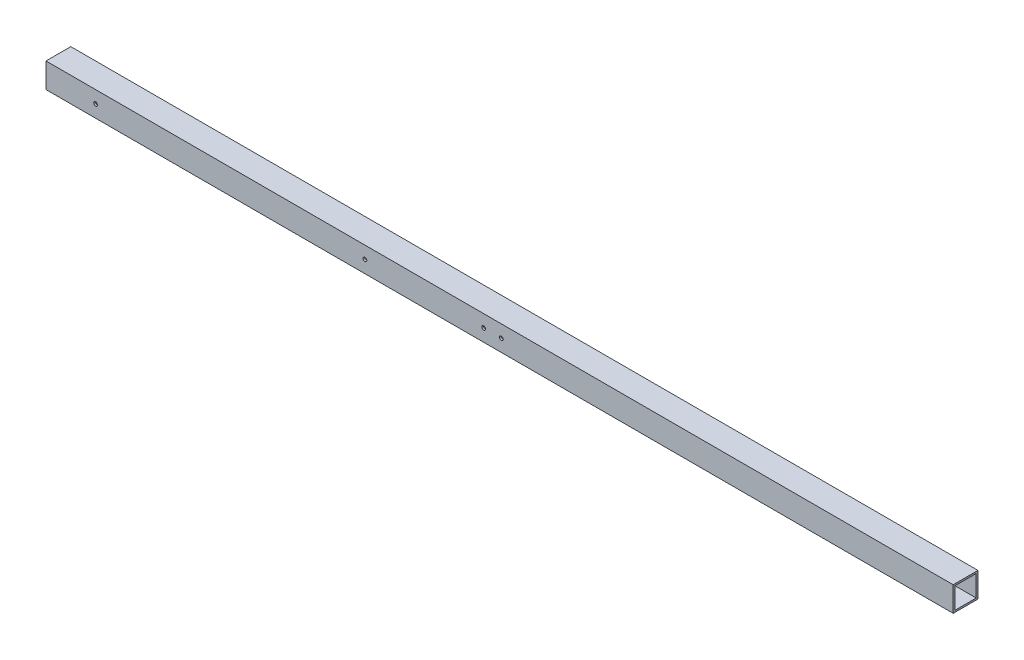
ISO-10303-21;
HEADER;
FILE_DESCRIPTION(('STEP AP214'),'2;1');
FILE_NAME('part.step','',(''),(''),'','','');
FILE_SCHEMA(('AUTOMOTIVE_DESIGN { 1 0 10303 214 1 1 1 1 }'));
ENDSEC;
DATA;
#1=APPLICATION_CONTEXT('core data for automotive mechanical design processes');
#2=APPLICATION_PROTOCOL_DEFINITION('international standard','automotive_design',2000,#1);
#3=PRODUCT_CONTEXT('',#1,'mechanical');
#4=PRODUCT('Part','Part','',(#3));
#5=PRODUCT_RELATED_PRODUCT_CATEGORY('part','',(#4));
#6=PRODUCT_DEFINITION_FORMATION('','',#4);
#7=PRODUCT_DEFINITION_CONTEXT('part definition',#1,'design');
#8=PRODUCT_DEFINITION('design','',#6,#7);
#9=PRODUCT_DEFINITION_SHAPE('','',#8);
#10=(LENGTH_UNIT() NAMED_UNIT(*) SI_UNIT(.MILLI.,.METRE.));
#11=(NAMED_UNIT(*) PLANE_ANGLE_UNIT() SI_UNIT($,.RADIAN.));
#12=(NAMED_UNIT(*) SI_UNIT($,.STERADIAN.) SOLID_ANGLE_UNIT());
#13=UNCERTAINTY_MEASURE_WITH_UNIT(LENGTH_MEASURE(1.E-05),#10,'distance_accuracy_value','');
#14=(GEOMETRIC_REPRESENTATION_CONTEXT(3) GLOBAL_UNCERTAINTY_ASSIGNED_CONTEXT((#13)) GLOBAL_UNIT_ASSIGNED_CONTEXT((#10,
#11,#12)) REPRESENTATION_CONTEXT('',''));
#15=CARTESIAN_POINT('',(0.,0.,0.));
#16=DIRECTION('',(0.,0.,1.));
#17=DIRECTION('',(1.,0.,0.));
#18=AXIS2_PLACEMENT_3D('',#15,#16,#17);
#19=CARTESIAN_POINT('',(1625.6,0.,0.));
#20=DIRECTION('',(-1.,0.,0.));
#21=DIRECTION('',(0.,0.,1.));
#22=AXIS2_PLACEMENT_3D('',#19,#20,#21);
#23=PLANE('',#22);
#24=DIRECTION('',(0.,-1.,0.));
#25=VECTOR('',#24,1.);
#26=CARTESIAN_POINT('',(1625.6,0.,0.));
#27=LINE('',#26,#25);
#28=CARTESIAN_POINT('',(1625.6,44.45,0.));
#29=VERTEX_POINT('',#28);
#30=CARTESIAN_POINT('',(1625.6,0.,0.));
#31=VERTEX_POINT('',#30);
#32=EDGE_CURVE('E139',#29,#31,#27,.T.);
#33=ORIENTED_EDGE('',*,*,#32,.T.);
#34=DIRECTION('',(0.,0.,-1.));
#35=VECTOR('',#34,1.);
#36=CARTESIAN_POINT('',(1625.6,0.,0.));
#37=LINE('',#36,#35);
#38=CARTESIAN_POINT('',(1625.6,0.,-44.45));
#39=VERTEX_POINT('',#38);
#40=EDGE_CURVE('E142',#31,#39,#37,.T.);
#41=ORIENTED_EDGE('',*,*,#40,.T.);
#42=DIRECTION('',(0.,1.,0.));
#43=VECTOR('',#42,1.);
#44=CARTESIAN_POINT('',(1625.6,0.,-44.45));
#45=LINE('',#44,#43);
#46=CARTESIAN_POINT('',(1625.6,44.45,-44.45));
#47=VERTEX_POINT('',#46);
#48=EDGE_CURVE('E145',#39,#47,#45,.T.);
#49=ORIENTED_EDGE('',*,*,#48,.T.);
#50=DIRECTION('',(0.,0.,1.));
#51=VECTOR('',#50,1.);
#52=CARTESIAN_POINT('',(1625.6,44.45,0.));
#53=LINE('',#52,#51);
#54=EDGE_CURVE('E147',#47,#29,#53,.T.);
#55=ORIENTED_EDGE('',*,*,#54,.T.);
#56=EDGE_LOOP('',(#33,#41,#49,#55));
#57=FACE_BOUND('',#56,.T.);
#58=DIRECTION('',(0.,-1.,0.));
#59=VECTOR('',#58,1.);
#60=CARTESIAN_POINT('',(1625.6,41.275,-3.175));
#61=LINE('',#60,#59);
#62=CARTESIAN_POINT('',(1625.6,41.275,-3.175));
#63=VERTEX_POINT('',#62);
#64=CARTESIAN_POINT('',(1625.6,3.175,-3.175));
#65=VERTEX_POINT('',#64);
#66=EDGE_CURVE('E101',#63,#65,#61,.T.);
#67=ORIENTED_EDGE('',*,*,#66,.F.);
#68=DIRECTION('',(0.,0.,1.));
#69=VECTOR('',#68,1.);
#70=CARTESIAN_POINT('',(1625.6,41.275,-3.175));
#71=LINE('',#70,#69);
#72=CARTESIAN_POINT('',(1625.6,41.275,-41.275));
#73=VERTEX_POINT('',#72);
#74=EDGE_CURVE('E123',#73,#63,#71,.T.);
#75=ORIENTED_EDGE('',*,*,#74,.F.);
#76=DIRECTION('',(0.,1.,0.));
#77=VECTOR('',#76,1.);
#78=CARTESIAN_POINT('',(1625.6,41.275,-41.275));
#79=LINE('',#78,#77);
#80=CARTESIAN_POINT('',(1625.6,3.175,-41.275));
#81=VERTEX_POINT('',#80);
#82=EDGE_CURVE('E121',#81,#73,#79,.T.);
#83=ORIENTED_EDGE('',*,*,#82,.F.);
#84=DIRECTION('',(0.,0.,-1.));
#85=VECTOR('',#84,1.);
#86=CARTESIAN_POINT('',(1625.6,3.175,-3.175));
#87=LINE('',#86,#85);
#88=EDGE_CURVE('E109',#65,#81,#87,.T.);
#89=ORIENTED_EDGE('',*,*,#88,.F.);
#90=EDGE_LOOP('',(#67,#75,#83,#89));
#91=FACE_BOUND('',#90,.T.);
#92=ADVANCED_FACE('F34',(#57,#91),#23,.F.);
#93=CARTESIAN_POINT('',(0.,0.,0.));
#94=DIRECTION('',(-1.,0.,0.));
#95=DIRECTION('',(0.,0.,1.));
#96=AXIS2_PLACEMENT_3D('',#93,#94,#95);
#97=PLANE('',#96);
#98=DIRECTION('',(0.,-1.,0.));
#99=VECTOR('',#98,1.);
#100=CARTESIAN_POINT('',(0.,0.,0.));
#101=LINE('',#100,#99);
#102=CARTESIAN_POINT('',(0.,44.45,0.));
#103=VERTEX_POINT('',#102);
#104=CARTESIAN_POINT('',(0.,0.,0.));
#105=VERTEX_POINT('',#104);
#106=EDGE_CURVE('E117',#103,#105,#101,.T.);
#107=ORIENTED_EDGE('',*,*,#106,.F.);
#108=DIRECTION('',(0.,0.,1.));
#109=VECTOR('',#108,1.);
#110=CARTESIAN_POINT('',(0.,44.45,0.));
#111=LINE('',#110,#109);
#112=CARTESIAN_POINT('',(0.,44.45,-44.45));
#113=VERTEX_POINT('',#112);
#114=EDGE_CURVE('E143',#113,#103,#111,.T.);
#115=ORIENTED_EDGE('',*,*,#114,.F.);
#116=DIRECTION('',(0.,1.,0.));
#117=VECTOR('',#116,1.);
#118=CARTESIAN_POINT('',(0.,0.,-44.45));
#119=LINE('',#118,#117);
#120=CARTESIAN_POINT('',(0.,0.,-44.45));
#121=VERTEX_POINT('',#120);
#122=EDGE_CURVE('E154',#121,#113,#119,.T.);
#123=ORIENTED_EDGE('',*,*,#122,.F.);
#124=DIRECTION('',(0.,0.,-1.));
#125=VECTOR('',#124,1.);
#126=CARTESIAN_POINT('',(0.,0.,0.));
#127=LINE('',#126,#125);
#128=EDGE_CURVE('E152',#105,#121,#127,.T.);
#129=ORIENTED_EDGE('',*,*,#128,.F.);
#130=EDGE_LOOP('',(#107,#115,#123,#129));
#131=FACE_BOUND('',#130,.T.);
#132=DIRECTION('',(0.,0.,1.));
#133=VECTOR('',#132,1.);
#134=CARTESIAN_POINT('',(0.,41.275,-3.175));
#135=LINE('',#134,#133);
#136=CARTESIAN_POINT('',(0.,41.275,-41.275));
#137=VERTEX_POINT('',#136);
#138=CARTESIAN_POINT('',(0.,41.275,-3.175));
#139=VERTEX_POINT('',#138);
#140=EDGE_CURVE('E110',#137,#139,#135,.T.);
#141=ORIENTED_EDGE('',*,*,#140,.T.);
#142=DIRECTION('',(0.,-1.,0.));
#143=VECTOR('',#142,1.);
#144=CARTESIAN_POINT('',(0.,41.275,-3.175));
#145=LINE('',#144,#143);
#146=CARTESIAN_POINT('',(0.,3.175,-3.175));
#147=VERTEX_POINT('',#146);
#148=EDGE_CURVE('E59',#139,#147,#145,.T.);
#149=ORIENTED_EDGE('',*,*,#148,.T.);
#150=DIRECTION('',(0.,0.,-1.));
#151=VECTOR('',#150,1.);
#152=CARTESIAN_POINT('',(0.,3.175,-3.175));
#153=LINE('',#152,#151);
#154=CARTESIAN_POINT('',(0.,3.175,-41.275));
#155=VERTEX_POINT('',#154);
#156=EDGE_CURVE('E116',#147,#155,#153,.T.);
#157=ORIENTED_EDGE('',*,*,#156,.T.);
#158=DIRECTION('',(0.,1.,0.));
#159=VECTOR('',#158,1.);
#160=CARTESIAN_POINT('',(0.,41.275,-41.275));
#161=LINE('',#160,#159);
#162=EDGE_CURVE('E131',#155,#137,#161,.T.);
#163=ORIENTED_EDGE('',*,*,#162,.T.);
#164=EDGE_LOOP('',(#141,#149,#157,#163));
#165=FACE_BOUND('',#164,.T.);
#166=ADVANCED_FACE('F206',(#131,#165),#97,.T.);
#167=CARTESIAN_POINT('',(1625.6,0.,0.));
#168=DIRECTION('',(0.,0.,-1.));
#169=DIRECTION('',(-1.,0.,0.));
#170=AXIS2_PLACEMENT_3D('',#167,#168,#169);
#171=PLANE('',#170);
#172=CARTESIAN_POINT('',(88.8999999999999,22.225,0.));
#173=DIRECTION('',(0.,0.,1.));
#174=DIRECTION('',(1.,0.,0.));
#175=AXIS2_PLACEMENT_3D('',#172,#173,#174);
#176=CIRCLE('',#175,3.37343749999999);
#177=CARTESIAN_POINT('',(92.2734374999999,22.225,0.));
#178=VERTEX_POINT('',#177);
#179=EDGE_CURVE('E259',#178,#178,#176,.T.);
#180=ORIENTED_EDGE('',*,*,#179,.F.);
#181=EDGE_LOOP('',(#180));
#182=FACE_BOUND('',#181,.T.);
#183=CARTESIAN_POINT('',(571.5,22.225,0.));
#184=DIRECTION('',(0.,0.,1.));
#185=DIRECTION('',(1.,0.,0.));
#186=AXIS2_PLACEMENT_3D('',#183,#184,#185);
#187=CIRCLE('',#186,3.37343749999992);
#188=CARTESIAN_POINT('',(574.8734375,22.225,0.));
#189=VERTEX_POINT('',#188);
#190=EDGE_CURVE('E263',#189,#189,#187,.T.);
#191=ORIENTED_EDGE('',*,*,#190,.F.);
#192=EDGE_LOOP('',(#191));
#193=FACE_BOUND('',#192,.T.);
#194=CARTESIAN_POINT('',(815.975,22.225,0.));
#195=DIRECTION('',(0.,0.,1.));
#196=DIRECTION('',(1.,0.,0.));
#197=AXIS2_PLACEMENT_3D('',#194,#195,#196);
#198=CIRCLE('',#197,3.37343749999992);
#199=CARTESIAN_POINT('',(819.3484375,22.225,0.));
#200=VERTEX_POINT('',#199);
#201=EDGE_CURVE('E267',#200,#200,#198,.T.);
#202=ORIENTED_EDGE('',*,*,#201,.F.);
#203=EDGE_LOOP('',(#202));
#204=FACE_BOUND('',#203,.T.);
#205=CARTESIAN_POINT('',(784.225,22.225,0.));
#206=DIRECTION('',(0.,0.,1.));
#207=DIRECTION('',(1.,0.,0.));
#208=AXIS2_PLACEMENT_3D('',#205,#206,#207);
#209=CIRCLE('',#208,3.37343749999992);
#210=CARTESIAN_POINT('',(787.5984375,22.225,0.));
#211=VERTEX_POINT('',#210);
#212=EDGE_CURVE('E270',#211,#211,#209,.T.);
#213=ORIENTED_EDGE('',*,*,#212,.F.);
#214=EDGE_LOOP('',(#213));
#215=FACE_BOUND('',#214,.T.);
#216=ORIENTED_EDGE('',*,*,#106,.T.);
#217=DIRECTION('',(-1.,0.,0.));
#218=VECTOR('',#217,1.);
#219=CARTESIAN_POINT('',(1625.6,0.,0.));
#220=LINE('',#219,#218);
#221=EDGE_CURVE('E11',#31,#105,#220,.T.);
#222=ORIENTED_EDGE('',*,*,#221,.F.);
#223=ORIENTED_EDGE('',*,*,#32,.F.);
#224=DIRECTION('',(-1.,0.,0.));
#225=VECTOR('',#224,1.);
#226=CARTESIAN_POINT('',(1625.6,44.45,0.));
#227=LINE('',#226,#225);
#228=EDGE_CURVE('E149',#29,#103,#227,.T.);
#229=ORIENTED_EDGE('',*,*,#228,.T.);
#230=EDGE_LOOP('',(#216,#222,#223,#229));
#231=FACE_BOUND('',#230,.T.);
#232=ADVANCED_FACE('F36',(#182,#193,#204,#215,#231),#171,.F.);
#233=CARTESIAN_POINT('',(1625.6,0.,0.));
#234=DIRECTION('',(0.,1.,0.));
#235=DIRECTION('',(0.,0.,1.));
#236=AXIS2_PLACEMENT_3D('',#233,#234,#235);
#237=PLANE('',#236);
#238=ORIENTED_EDGE('',*,*,#128,.T.);
#239=DIRECTION('',(-1.,0.,0.));
#240=VECTOR('',#239,1.);
#241=CARTESIAN_POINT('',(1625.6,0.,-44.45));
#242=LINE('',#241,#240);
#243=EDGE_CURVE('E43',#39,#121,#242,.T.);
#244=ORIENTED_EDGE('',*,*,#243,.F.);
#245=ORIENTED_EDGE('',*,*,#40,.F.);
#246=ORIENTED_EDGE('',*,*,#221,.T.);
#247=EDGE_LOOP('',(#238,#244,#245,#246));
#248=FACE_BOUND('',#247,.T.);
#249=ADVANCED_FACE('F234',(#248),#237,.F.);
#250=CARTESIAN_POINT('',(1625.6,0.,-44.45));
#251=DIRECTION('',(0.,0.,1.));
#252=DIRECTION('',(1.,0.,0.));
#253=AXIS2_PLACEMENT_3D('',#250,#251,#252);
#254=PLANE('',#253);
#255=CARTESIAN_POINT('',(88.8999999999999,22.225,-44.45));
#256=DIRECTION('',(0.,0.,1.));
#257=DIRECTION('',(1.,0.,0.));
#258=AXIS2_PLACEMENT_3D('',#255,#256,#257);
#259=CIRCLE('',#258,3.37343749999999);
#260=CARTESIAN_POINT('',(92.2734374999999,22.225,-44.45));
#261=VERTEX_POINT('',#260);
#262=EDGE_CURVE('E279',#261,#261,#259,.T.);
#263=ORIENTED_EDGE('',*,*,#262,.T.);
#264=EDGE_LOOP('',(#263));
#265=FACE_BOUND('',#264,.T.);
#266=CARTESIAN_POINT('',(571.5,22.225,-44.45));
#267=DIRECTION('',(0.,0.,1.));
#268=DIRECTION('',(1.,0.,0.));
#269=AXIS2_PLACEMENT_3D('',#266,#267,#268);
#270=CIRCLE('',#269,3.37343749999992);
#271=CARTESIAN_POINT('',(574.8734375,22.225,-44.45));
#272=VERTEX_POINT('',#271);
#273=EDGE_CURVE('E283',#272,#272,#270,.T.);
#274=ORIENTED_EDGE('',*,*,#273,.T.);
#275=EDGE_LOOP('',(#274));
#276=FACE_BOUND('',#275,.T.);
#277=CARTESIAN_POINT('',(815.975,22.225,-44.45));
#278=DIRECTION('',(0.,0.,1.));
#279=DIRECTION('',(1.,0.,0.));
#280=AXIS2_PLACEMENT_3D('',#277,#278,#279);
#281=CIRCLE('',#280,3.37343749999992);
#282=CARTESIAN_POINT('',(819.3484375,22.225,-44.45));
#283=VERTEX_POINT('',#282);
#284=EDGE_CURVE('E272',#283,#283,#281,.T.);
#285=ORIENTED_EDGE('',*,*,#284,.T.);
#286=EDGE_LOOP('',(#285));
#287=FACE_BOUND('',#286,.T.);
#288=CARTESIAN_POINT('',(784.225,22.225,-44.45));
#289=DIRECTION('',(0.,0.,1.));
#290=DIRECTION('',(1.,0.,0.));
#291=AXIS2_PLACEMENT_3D('',#288,#289,#290);
#292=CIRCLE('',#291,3.37343749999992);
#293=CARTESIAN_POINT('',(787.5984375,22.225,-44.45));
#294=VERTEX_POINT('',#293);
#295=EDGE_CURVE('E168',#294,#294,#292,.T.);
#296=ORIENTED_EDGE('',*,*,#295,.T.);
#297=EDGE_LOOP('',(#296));
#298=FACE_BOUND('',#297,.T.);
#299=ORIENTED_EDGE('',*,*,#122,.T.);
#300=DIRECTION('',(-1.,0.,0.));
#301=VECTOR('',#300,1.);
#302=CARTESIAN_POINT('',(1625.6,44.45,-44.45));
#303=LINE('',#302,#301);
#304=EDGE_CURVE('E159',#47,#113,#303,.T.);
#305=ORIENTED_EDGE('',*,*,#304,.F.);
#306=ORIENTED_EDGE('',*,*,#48,.F.);
#307=ORIENTED_EDGE('',*,*,#243,.T.);
#308=EDGE_LOOP('',(#299,#305,#306,#307));
#309=FACE_BOUND('',#308,.T.);
#310=ADVANCED_FACE('F231',(#265,#276,#287,#298,#309),#254,.F.);
#311=CARTESIAN_POINT('',(1625.6,44.45,0.));
#312=DIRECTION('',(0.,-1.,0.));
#313=DIRECTION('',(0.,0.,-1.));
#314=AXIS2_PLACEMENT_3D('',#311,#312,#313);
#315=PLANE('',#314);
#316=ORIENTED_EDGE('',*,*,#114,.T.);
#317=ORIENTED_EDGE('',*,*,#228,.F.);
#318=ORIENTED_EDGE('',*,*,#54,.F.);
#319=ORIENTED_EDGE('',*,*,#304,.T.);
#320=EDGE_LOOP('',(#316,#317,#318,#319));
#321=FACE_BOUND('',#320,.T.);
#322=ADVANCED_FACE('F228',(#321),#315,.F.);
#323=CARTESIAN_POINT('',(1625.6,41.275,-3.175));
#324=DIRECTION('',(0.,0.,-1.));
#325=DIRECTION('',(0.,1.,0.));
#326=AXIS2_PLACEMENT_3D('',#323,#324,#325);
#327=PLANE('',#326);
#328=CARTESIAN_POINT('',(88.8999999999999,22.225,-3.175));
#329=DIRECTION('',(0.,0.,-1.));
#330=DIRECTION('',(0.,1.,0.));
#331=AXIS2_PLACEMENT_3D('',#328,#329,#330);
#332=CIRCLE('',#331,3.37343749999999);
#333=CARTESIAN_POINT('',(88.8999999999999,25.5984375,-3.175));
#334=VERTEX_POINT('',#333);
#335=EDGE_CURVE('E129',#334,#334,#332,.T.);
#336=ORIENTED_EDGE('',*,*,#335,.F.);
#337=EDGE_LOOP('',(#336));
#338=FACE_BOUND('',#337,.T.);
#339=CARTESIAN_POINT('',(571.5,22.225,-3.175));
#340=DIRECTION('',(0.,0.,-1.));
#341=DIRECTION('',(0.,1.,0.));
#342=AXIS2_PLACEMENT_3D('',#339,#340,#341);
#343=CIRCLE('',#342,3.37343749999992);
#344=CARTESIAN_POINT('',(571.5,25.5984374999999,-3.175));
#345=VERTEX_POINT('',#344);
#346=EDGE_CURVE('E174',#345,#345,#343,.T.);
#347=ORIENTED_EDGE('',*,*,#346,.F.);
#348=EDGE_LOOP('',(#347));
#349=FACE_BOUND('',#348,.T.);
#350=CARTESIAN_POINT('',(815.975,22.225,-3.175));
#351=DIRECTION('',(0.,0.,-1.));
#352=DIRECTION('',(0.,1.,0.));
#353=AXIS2_PLACEMENT_3D('',#350,#351,#352);
#354=CIRCLE('',#353,3.37343749999992);
#355=CARTESIAN_POINT('',(815.975,25.5984374999999,-3.175));
#356=VERTEX_POINT('',#355);
#357=EDGE_CURVE('E171',#356,#356,#354,.T.);
#358=ORIENTED_EDGE('',*,*,#357,.F.);
#359=EDGE_LOOP('',(#358));
#360=FACE_BOUND('',#359,.T.);
#361=CARTESIAN_POINT('',(784.225,22.225,-3.175));
#362=DIRECTION('',(0.,0.,-1.));
#363=DIRECTION('',(0.,1.,0.));
#364=AXIS2_PLACEMENT_3D('',#361,#362,#363);
#365=CIRCLE('',#364,3.37343749999992);
#366=CARTESIAN_POINT('',(784.225,25.5984374999999,-3.175));
#367=VERTEX_POINT('',#366);
#368=EDGE_CURVE('E167',#367,#367,#365,.T.);
#369=ORIENTED_EDGE('',*,*,#368,.F.);
#370=EDGE_LOOP('',(#369));
#371=FACE_BOUND('',#370,.T.);
#372=ORIENTED_EDGE('',*,*,#148,.F.);
#373=DIRECTION('',(-1.,0.,0.));
#374=VECTOR('',#373,1.);
#375=CARTESIAN_POINT('',(1625.6,41.275,-3.175));
#376=LINE('',#375,#374);
#377=EDGE_CURVE('E105',#63,#139,#376,.T.);
#378=ORIENTED_EDGE('',*,*,#377,.F.);
#379=ORIENTED_EDGE('',*,*,#66,.T.);
#380=DIRECTION('',(-1.,0.,0.));
#381=VECTOR('',#380,1.);
#382=CARTESIAN_POINT('',(1625.6,3.175,-3.175));
#383=LINE('',#382,#381);
#384=EDGE_CURVE('E104',#65,#147,#383,.T.);
#385=ORIENTED_EDGE('',*,*,#384,.T.);
#386=EDGE_LOOP('',(#372,#378,#379,#385));
#387=FACE_BOUND('',#386,.T.);
#388=ADVANCED_FACE('F103',(#338,#349,#360,#371,#387),#327,.T.);
#389=CARTESIAN_POINT('',(1625.6,3.175,-3.175));
#390=DIRECTION('',(0.,1.,0.));
#391=DIRECTION('',(0.,0.,1.));
#392=AXIS2_PLACEMENT_3D('',#389,#390,#391);
#393=PLANE('',#392);
#394=ORIENTED_EDGE('',*,*,#156,.F.);
#395=ORIENTED_EDGE('',*,*,#384,.F.);
#396=ORIENTED_EDGE('',*,*,#88,.T.);
#397=DIRECTION('',(-1.,0.,0.));
#398=VECTOR('',#397,1.);
#399=CARTESIAN_POINT('',(1625.6,3.175,-41.275));
#400=LINE('',#399,#398);
#401=EDGE_CURVE('E118',#81,#155,#400,.T.);
#402=ORIENTED_EDGE('',*,*,#401,.T.);
#403=EDGE_LOOP('',(#394,#395,#396,#402));
#404=FACE_BOUND('',#403,.T.);
#405=ADVANCED_FACE('F113',(#404),#393,.T.);
#406=CARTESIAN_POINT('',(1625.6,41.275,-41.275));
#407=DIRECTION('',(0.,0.,1.));
#408=DIRECTION('',(0.,-1.,0.));
#409=AXIS2_PLACEMENT_3D('',#406,#407,#408);
#410=PLANE('',#409);
#411=CARTESIAN_POINT('',(88.8999999999999,22.225,-41.275));
#412=DIRECTION('',(0.,0.,1.));
#413=DIRECTION('',(0.,-1.,0.));
#414=AXIS2_PLACEMENT_3D('',#411,#412,#413);
#415=CIRCLE('',#414,3.37343749999999);
#416=CARTESIAN_POINT('',(88.8999999999999,18.8515625,-41.275));
#417=VERTEX_POINT('',#416);
#418=EDGE_CURVE('E38',#417,#417,#415,.T.);
#419=ORIENTED_EDGE('',*,*,#418,.F.);
#420=EDGE_LOOP('',(#419));
#421=FACE_BOUND('',#420,.T.);
#422=CARTESIAN_POINT('',(571.5,22.225,-41.275));
#423=DIRECTION('',(0.,0.,1.));
#424=DIRECTION('',(0.,-1.,0.));
#425=AXIS2_PLACEMENT_3D('',#422,#423,#424);
#426=CIRCLE('',#425,3.37343749999992);
#427=CARTESIAN_POINT('',(571.5,18.8515625000001,-41.275));
#428=VERTEX_POINT('',#427);
#429=EDGE_CURVE('E172',#428,#428,#426,.T.);
#430=ORIENTED_EDGE('',*,*,#429,.F.);
#431=EDGE_LOOP('',(#430));
#432=FACE_BOUND('',#431,.T.);
#433=CARTESIAN_POINT('',(815.975,22.225,-41.275));
#434=DIRECTION('',(0.,0.,1.));
#435=DIRECTION('',(0.,-1.,0.));
#436=AXIS2_PLACEMENT_3D('',#433,#434,#435);
#437=CIRCLE('',#436,3.37343749999992);
#438=CARTESIAN_POINT('',(815.975,18.8515625000001,-41.275));
#439=VERTEX_POINT('',#438);
#440=EDGE_CURVE('E169',#439,#439,#437,.T.);
#441=ORIENTED_EDGE('',*,*,#440,.F.);
#442=EDGE_LOOP('',(#441));
#443=FACE_BOUND('',#442,.T.);
#444=CARTESIAN_POINT('',(784.225,22.225,-41.275));
#445=DIRECTION('',(0.,0.,1.));
#446=DIRECTION('',(0.,-1.,0.));
#447=AXIS2_PLACEMENT_3D('',#444,#445,#446);
#448=CIRCLE('',#447,3.37343749999992);
#449=CARTESIAN_POINT('',(784.225,18.8515625000001,-41.275));
#450=VERTEX_POINT('',#449);
#451=EDGE_CURVE('E164',#450,#450,#448,.T.);
#452=ORIENTED_EDGE('',*,*,#451,.F.);
#453=EDGE_LOOP('',(#452));
#454=FACE_BOUND('',#453,.T.);
#455=ORIENTED_EDGE('',*,*,#162,.F.);
#456=ORIENTED_EDGE('',*,*,#401,.F.);
#457=ORIENTED_EDGE('',*,*,#82,.T.);
#458=DIRECTION('',(-1.,0.,0.));
#459=VECTOR('',#458,1.);
#460=CARTESIAN_POINT('',(1625.6,41.275,-41.275));
#461=LINE('',#460,#459);
#462=EDGE_CURVE('E51',#73,#137,#461,.T.);
#463=ORIENTED_EDGE('',*,*,#462,.T.);
#464=EDGE_LOOP('',(#455,#456,#457,#463));
#465=FACE_BOUND('',#464,.T.);
#466=ADVANCED_FACE('F194',(#421,#432,#443,#454,#465),#410,.T.);
#467=CARTESIAN_POINT('',(1625.6,41.275,-3.175));
#468=DIRECTION('',(0.,-1.,0.));
#469=DIRECTION('',(0.,0.,-1.));
#470=AXIS2_PLACEMENT_3D('',#467,#468,#469);
#471=PLANE('',#470);
#472=ORIENTED_EDGE('',*,*,#140,.F.);
#473=ORIENTED_EDGE('',*,*,#462,.F.);
#474=ORIENTED_EDGE('',*,*,#74,.T.);
#475=ORIENTED_EDGE('',*,*,#377,.T.);
#476=EDGE_LOOP('',(#472,#473,#474,#475));
#477=FACE_BOUND('',#476,.T.);
#478=ADVANCED_FACE('F197',(#477),#471,.T.);
#479=CARTESIAN_POINT('',(784.225,22.225,-44.45));
#480=DIRECTION('',(0.,0.,1.));
#481=DIRECTION('',(1.,0.,0.));
#482=AXIS2_PLACEMENT_3D('',#479,#480,#481);
#483=CYLINDRICAL_SURFACE('',#482,3.37343749999992);
#484=ORIENTED_EDGE('',*,*,#451,.T.);
#485=EDGE_LOOP('',(#484));
#486=FACE_BOUND('',#485,.T.);
#487=ORIENTED_EDGE('',*,*,#295,.F.);
#488=EDGE_LOOP('',(#487));
#489=FACE_BOUND('',#488,.T.);
#490=ADVANCED_FACE('F208',(#486,#489),#483,.F.);
#491=CARTESIAN_POINT('',(815.975,22.225,-44.45));
#492=DIRECTION('',(0.,0.,1.));
#493=DIRECTION('',(1.,0.,0.));
#494=AXIS2_PLACEMENT_3D('',#491,#492,#493);
#495=CYLINDRICAL_SURFACE('',#494,3.37343749999992);
#496=ORIENTED_EDGE('',*,*,#440,.T.);
#497=EDGE_LOOP('',(#496));
#498=FACE_BOUND('',#497,.T.);
#499=ORIENTED_EDGE('',*,*,#284,.F.);
#500=EDGE_LOOP('',(#499));
#501=FACE_BOUND('',#500,.T.);
#502=ADVANCED_FACE('F213',(#498,#501),#495,.F.);
#503=CARTESIAN_POINT('',(571.5,22.225,-44.45));
#504=DIRECTION('',(0.,0.,1.));
#505=DIRECTION('',(1.,0.,0.));
#506=AXIS2_PLACEMENT_3D('',#503,#504,#505);
#507=CYLINDRICAL_SURFACE('',#506,3.37343749999992);
#508=ORIENTED_EDGE('',*,*,#429,.T.);
#509=EDGE_LOOP('',(#508));
#510=FACE_BOUND('',#509,.T.);
#511=ORIENTED_EDGE('',*,*,#273,.F.);
#512=EDGE_LOOP('',(#511));
#513=FACE_BOUND('',#512,.T.);
#514=ADVANCED_FACE('F298',(#510,#513),#507,.F.);
#515=CARTESIAN_POINT('',(88.8999999999999,22.225,-44.45));
#516=DIRECTION('',(0.,0.,1.));
#517=DIRECTION('',(1.,0.,0.));
#518=AXIS2_PLACEMENT_3D('',#515,#516,#517);
#519=CYLINDRICAL_SURFACE('',#518,3.37343749999999);
#520=ORIENTED_EDGE('',*,*,#418,.T.);
#521=EDGE_LOOP('',(#520));
#522=FACE_BOUND('',#521,.T.);
#523=ORIENTED_EDGE('',*,*,#262,.F.);
#524=EDGE_LOOP('',(#523));
#525=FACE_BOUND('',#524,.T.);
#526=ADVANCED_FACE('F191',(#522,#525),#519,.F.);
#527=ORIENTED_EDGE('',*,*,#368,.T.);
#528=EDGE_LOOP('',(#527));
#529=FACE_BOUND('',#528,.T.);
#530=ORIENTED_EDGE('',*,*,#212,.T.);
#531=EDGE_LOOP('',(#530));
#532=FACE_BOUND('',#531,.T.);
#533=ADVANCED_FACE('F216',(#529,#532),#483,.F.);
#534=ORIENTED_EDGE('',*,*,#357,.T.);
#535=EDGE_LOOP('',(#534));
#536=FACE_BOUND('',#535,.T.);
#537=ORIENTED_EDGE('',*,*,#201,.T.);
#538=EDGE_LOOP('',(#537));
#539=FACE_BOUND('',#538,.T.);
#540=ADVANCED_FACE('F287',(#536,#539),#495,.F.);
#541=ORIENTED_EDGE('',*,*,#346,.T.);
#542=EDGE_LOOP('',(#541));
#543=FACE_BOUND('',#542,.T.);
#544=ORIENTED_EDGE('',*,*,#190,.T.);
#545=EDGE_LOOP('',(#544));
#546=FACE_BOUND('',#545,.T.);
#547=ADVANCED_FACE('F289',(#543,#546),#507,.F.);
#548=ORIENTED_EDGE('',*,*,#335,.T.);
#549=EDGE_LOOP('',(#548));
#550=FACE_BOUND('',#549,.T.);
#551=ORIENTED_EDGE('',*,*,#179,.T.);
#552=EDGE_LOOP('',(#551));
#553=FACE_BOUND('',#552,.T.);
#554=ADVANCED_FACE('F295',(#550,#553),#519,.F.);
#555=CLOSED_SHELL('',(#92,#166,#232,#249,#310,#322,#388,#405,#466,#478,#490,#502,#514,#526,#533,
#540,#547,#554));
#556=MANIFOLD_SOLID_BREP('B2',#555);
#557=ADVANCED_BREP_SHAPE_REPRESENTATION('',(#18,#556),#14);
#558=SHAPE_DEFINITION_REPRESENTATION(#9,#557);
ENDSEC;
END-ISO-10303-21;
